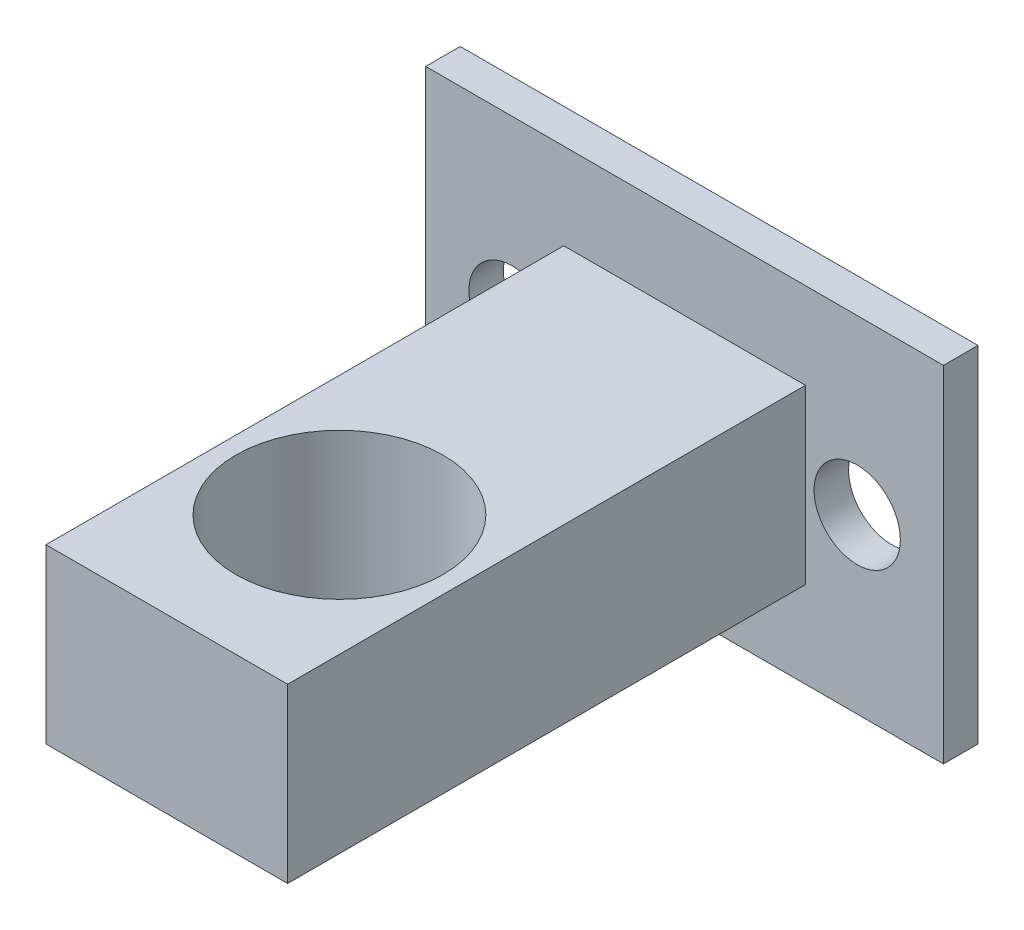
ISO-10303-21;
HEADER;
FILE_DESCRIPTION(('STEP AP214'),'2;1');
FILE_NAME('part.step','',(''),(''),'','','');
FILE_SCHEMA(('AUTOMOTIVE_DESIGN { 1 0 10303 214 1 1 1 1 }'));
ENDSEC;
DATA;
#1=APPLICATION_CONTEXT('core data for automotive mechanical design processes');
#2=APPLICATION_PROTOCOL_DEFINITION('international standard','automotive_design',2000,#1);
#3=PRODUCT_CONTEXT('',#1,'mechanical');
#4=PRODUCT('Part','Part','',(#3));
#5=PRODUCT_RELATED_PRODUCT_CATEGORY('part','',(#4));
#6=PRODUCT_DEFINITION_FORMATION('','',#4);
#7=PRODUCT_DEFINITION_CONTEXT('part definition',#1,'design');
#8=PRODUCT_DEFINITION('design','',#6,#7);
#9=PRODUCT_DEFINITION_SHAPE('','',#8);
#10=(LENGTH_UNIT() NAMED_UNIT(*) SI_UNIT(.MILLI.,.METRE.));
#11=(NAMED_UNIT(*) PLANE_ANGLE_UNIT() SI_UNIT($,.RADIAN.));
#12=(NAMED_UNIT(*) SI_UNIT($,.STERADIAN.) SOLID_ANGLE_UNIT());
#13=UNCERTAINTY_MEASURE_WITH_UNIT(LENGTH_MEASURE(1.E-05),#10,'distance_accuracy_value','');
#14=(GEOMETRIC_REPRESENTATION_CONTEXT(3) GLOBAL_UNCERTAINTY_ASSIGNED_CONTEXT((#13)) GLOBAL_UNIT_ASSIGNED_CONTEXT((#10,
#11,#12)) REPRESENTATION_CONTEXT('',''));
#15=CARTESIAN_POINT('',(0.,0.,0.));
#16=DIRECTION('',(0.,0.,1.));
#17=DIRECTION('',(1.,0.,0.));
#18=AXIS2_PLACEMENT_3D('',#15,#16,#17);
#19=CARTESIAN_POINT('',(0.,0.,2.));
#20=DIRECTION('',(0.,0.,-1.));
#21=DIRECTION('',(-1.,0.,0.));
#22=AXIS2_PLACEMENT_3D('',#19,#20,#21);
#23=PLANE('',#22);
#24=CARTESIAN_POINT('',(-5.82193865754765,8.4931631945286,2.));
#25=DIRECTION('',(0.,0.,1.));
#26=DIRECTION('',(1.,0.,0.));
#27=AXIS2_PLACEMENT_3D('',#24,#25,#26);
#28=CIRCLE('',#27,2.5);
#29=CARTESIAN_POINT('',(-3.32193865754765,8.4931631945286,2.));
#30=VERTEX_POINT('',#29);
#31=EDGE_CURVE('E125',#30,#30,#28,.T.);
#32=ORIENTED_EDGE('',*,*,#31,.F.);
#33=EDGE_LOOP('',(#32));
#34=FACE_BOUND('',#33,.T.);
#35=CARTESIAN_POINT('',(-25.8219386575476,8.4931631945286,2.));
#36=DIRECTION('',(0.,0.,1.));
#37=DIRECTION('',(1.,0.,0.));
#38=AXIS2_PLACEMENT_3D('',#35,#36,#37);
#39=CIRCLE('',#38,2.5);
#40=CARTESIAN_POINT('',(-23.3219386575476,8.4931631945286,2.));
#41=VERTEX_POINT('',#40);
#42=EDGE_CURVE('E134',#41,#41,#39,.T.);
#43=ORIENTED_EDGE('',*,*,#42,.F.);
#44=EDGE_LOOP('',(#43));
#45=FACE_BOUND('',#44,.T.);
#46=DIRECTION('',(0.,-1.,0.));
#47=VECTOR('',#46,1.);
#48=CARTESIAN_POINT('',(-30.8219386575476,-1.50683680547141,2.));
#49=LINE('',#48,#47);
#50=CARTESIAN_POINT('',(-30.8219386575476,18.4931631945286,2.));
#51=VERTEX_POINT('',#50);
#52=CARTESIAN_POINT('',(-30.8219386575476,-1.50683680547141,2.));
#53=VERTEX_POINT('',#52);
#54=EDGE_CURVE('E140',#51,#53,#49,.T.);
#55=ORIENTED_EDGE('',*,*,#54,.T.);
#56=DIRECTION('',(1.,0.,0.));
#57=VECTOR('',#56,1.);
#58=CARTESIAN_POINT('',(-0.821938657547647,-1.50683680547141,2.));
#59=LINE('',#58,#57);
#60=CARTESIAN_POINT('',(-0.821938657547647,-1.50683680547141,2.));
#61=VERTEX_POINT('',#60);
#62=EDGE_CURVE('E143',#53,#61,#59,.T.);
#63=ORIENTED_EDGE('',*,*,#62,.T.);
#64=DIRECTION('',(0.,1.,0.));
#65=VECTOR('',#64,1.);
#66=CARTESIAN_POINT('',(-0.821938657547649,8.4931631945286,2.));
#67=LINE('',#66,#65);
#68=CARTESIAN_POINT('',(-0.821938657547649,18.4931631945286,2.));
#69=VERTEX_POINT('',#68);
#70=EDGE_CURVE('E146',#61,#69,#67,.T.);
#71=ORIENTED_EDGE('',*,*,#70,.T.);
#72=DIRECTION('',(-1.,0.,0.));
#73=VECTOR('',#72,1.);
#74=CARTESIAN_POINT('',(-30.8219386575476,18.4931631945286,2.));
#75=LINE('',#74,#73);
#76=EDGE_CURVE('E148',#69,#51,#75,.T.);
#77=ORIENTED_EDGE('',*,*,#76,.T.);
#78=EDGE_LOOP('',(#55,#63,#71,#77));
#79=FACE_BOUND('',#78,.T.);
#80=DIRECTION('',(0.,-1.,0.));
#81=VECTOR('',#80,1.);
#82=CARTESIAN_POINT('',(-22.8219386575476,13.4931631945286,2.));
#83=LINE('',#82,#81);
#84=CARTESIAN_POINT('',(-22.8219386575476,13.4931631945286,2.));
#85=VERTEX_POINT('',#84);
#86=CARTESIAN_POINT('',(-22.8219386575476,3.4931631945286,2.));
#87=VERTEX_POINT('',#86);
#88=EDGE_CURVE('E121',#85,#87,#83,.T.);
#89=ORIENTED_EDGE('',*,*,#88,.F.);
#90=DIRECTION('',(-1.,0.,0.));
#91=VECTOR('',#90,1.);
#92=CARTESIAN_POINT('',(-15.8219386575476,13.4931631945286,2.));
#93=LINE('',#92,#91);
#94=CARTESIAN_POINT('',(-8.82193865754765,13.4931631945286,2.));
#95=VERTEX_POINT('',#94);
#96=EDGE_CURVE('E118',#95,#85,#93,.T.);
#97=ORIENTED_EDGE('',*,*,#96,.F.);
#98=DIRECTION('',(0.,1.,0.));
#99=VECTOR('',#98,1.);
#100=CARTESIAN_POINT('',(-8.82193865754765,3.49316319452859,2.));
#101=LINE('',#100,#99);
#102=CARTESIAN_POINT('',(-8.82193865754765,3.49316319452859,2.));
#103=VERTEX_POINT('',#102);
#104=EDGE_CURVE('E56',#103,#95,#101,.T.);
#105=ORIENTED_EDGE('',*,*,#104,.F.);
#106=DIRECTION('',(1.,0.,0.));
#107=VECTOR('',#106,1.);
#108=CARTESIAN_POINT('',(-22.8219386575476,3.4931631945286,2.));
#109=LINE('',#108,#107);
#110=EDGE_CURVE('E51',#87,#103,#109,.T.);
#111=ORIENTED_EDGE('',*,*,#110,.F.);
#112=EDGE_LOOP('',(#89,#97,#105,#111));
#113=FACE_BOUND('',#112,.T.);
#114=ADVANCED_FACE('F35',(#34,#45,#79,#113),#23,.F.);
#115=CARTESIAN_POINT('',(0.,0.,0.));
#116=DIRECTION('',(0.,0.,-1.));
#117=DIRECTION('',(-1.,0.,0.));
#118=AXIS2_PLACEMENT_3D('',#115,#116,#117);
#119=PLANE('',#118);
#120=CARTESIAN_POINT('',(-25.8219386575476,8.4931631945286,0.));
#121=DIRECTION('',(0.,0.,1.));
#122=DIRECTION('',(1.,0.,0.));
#123=AXIS2_PLACEMENT_3D('',#120,#121,#122);
#124=CIRCLE('',#123,2.5);
#125=CARTESIAN_POINT('',(-23.3219386575476,8.4931631945286,0.));
#126=VERTEX_POINT('',#125);
#127=EDGE_CURVE('E132',#126,#126,#124,.T.);
#128=ORIENTED_EDGE('',*,*,#127,.T.);
#129=EDGE_LOOP('',(#128));
#130=FACE_BOUND('',#129,.T.);
#131=DIRECTION('',(0.,-1.,0.));
#132=VECTOR('',#131,1.);
#133=CARTESIAN_POINT('',(-30.8219386575476,-1.50683680547141,0.));
#134=LINE('',#133,#132);
#135=CARTESIAN_POINT('',(-30.8219386575476,18.4931631945286,0.));
#136=VERTEX_POINT('',#135);
#137=CARTESIAN_POINT('',(-30.8219386575476,-1.50683680547141,0.));
#138=VERTEX_POINT('',#137);
#139=EDGE_CURVE('E137',#136,#138,#134,.T.);
#140=ORIENTED_EDGE('',*,*,#139,.F.);
#141=DIRECTION('',(-1.,0.,0.));
#142=VECTOR('',#141,1.);
#143=CARTESIAN_POINT('',(-30.8219386575476,18.4931631945286,0.));
#144=LINE('',#143,#142);
#145=CARTESIAN_POINT('',(-0.821938657547649,18.4931631945286,0.));
#146=VERTEX_POINT('',#145);
#147=EDGE_CURVE('E144',#146,#136,#144,.T.);
#148=ORIENTED_EDGE('',*,*,#147,.F.);
#149=DIRECTION('',(0.,1.,0.));
#150=VECTOR('',#149,1.);
#151=CARTESIAN_POINT('',(-0.821938657547649,18.4931631945286,0.));
#152=LINE('',#151,#150);
#153=CARTESIAN_POINT('',(-0.821938657547647,-1.50683680547141,0.));
#154=VERTEX_POINT('',#153);
#155=EDGE_CURVE('E156',#154,#146,#152,.T.);
#156=ORIENTED_EDGE('',*,*,#155,.F.);
#157=DIRECTION('',(1.,0.,0.));
#158=VECTOR('',#157,1.);
#159=CARTESIAN_POINT('',(-0.821938657547647,-1.50683680547141,0.));
#160=LINE('',#159,#158);
#161=EDGE_CURVE('E153',#138,#154,#160,.T.);
#162=ORIENTED_EDGE('',*,*,#161,.F.);
#163=EDGE_LOOP('',(#140,#148,#156,#162));
#164=FACE_BOUND('',#163,.T.);
#165=CARTESIAN_POINT('',(-5.82193865754765,8.4931631945286,0.));
#166=DIRECTION('',(0.,0.,1.));
#167=DIRECTION('',(1.,0.,0.));
#168=AXIS2_PLACEMENT_3D('',#165,#166,#167);
#169=CIRCLE('',#168,2.5);
#170=CARTESIAN_POINT('',(-3.32193865754765,8.4931631945286,0.));
#171=VERTEX_POINT('',#170);
#172=EDGE_CURVE('E122',#171,#171,#169,.T.);
#173=ORIENTED_EDGE('',*,*,#172,.T.);
#174=EDGE_LOOP('',(#173));
#175=FACE_BOUND('',#174,.T.);
#176=ADVANCED_FACE('F175',(#130,#164,#175),#119,.T.);
#177=CARTESIAN_POINT('',(-30.8219386575476,-1.50683680547141,2.));
#178=DIRECTION('',(1.,0.,0.));
#179=DIRECTION('',(0.,0.,-1.));
#180=AXIS2_PLACEMENT_3D('',#177,#178,#179);
#181=PLANE('',#180);
#182=ORIENTED_EDGE('',*,*,#139,.T.);
#183=DIRECTION('',(0.,0.,-1.));
#184=VECTOR('',#183,1.);
#185=CARTESIAN_POINT('',(-30.8219386575476,-1.50683680547141,2.));
#186=LINE('',#185,#184);
#187=EDGE_CURVE('E11',#53,#138,#186,.T.);
#188=ORIENTED_EDGE('',*,*,#187,.F.);
#189=ORIENTED_EDGE('',*,*,#54,.F.);
#190=DIRECTION('',(0.,0.,-1.));
#191=VECTOR('',#190,1.);
#192=CARTESIAN_POINT('',(-30.8219386575476,18.4931631945286,2.));
#193=LINE('',#192,#191);
#194=EDGE_CURVE('E150',#51,#136,#193,.T.);
#195=ORIENTED_EDGE('',*,*,#194,.T.);
#196=EDGE_LOOP('',(#182,#188,#189,#195));
#197=FACE_BOUND('',#196,.T.);
#198=ADVANCED_FACE('F37',(#197),#181,.F.);
#199=CARTESIAN_POINT('',(-0.821938657547647,-1.50683680547141,2.));
#200=DIRECTION('',(0.,1.,0.));
#201=DIRECTION('',(0.,0.,1.));
#202=AXIS2_PLACEMENT_3D('',#199,#200,#201);
#203=PLANE('',#202);
#204=ORIENTED_EDGE('',*,*,#161,.T.);
#205=DIRECTION('',(0.,0.,-1.));
#206=VECTOR('',#205,1.);
#207=CARTESIAN_POINT('',(-0.821938657547647,-1.50683680547141,2.));
#208=LINE('',#207,#206);
#209=EDGE_CURVE('E44',#61,#154,#208,.T.);
#210=ORIENTED_EDGE('',*,*,#209,.F.);
#211=ORIENTED_EDGE('',*,*,#62,.F.);
#212=ORIENTED_EDGE('',*,*,#187,.T.);
#213=EDGE_LOOP('',(#204,#210,#211,#212));
#214=FACE_BOUND('',#213,.T.);
#215=ADVANCED_FACE('F171',(#214),#203,.F.);
#216=CARTESIAN_POINT('',(-0.821938657547649,18.4931631945286,2.));
#217=DIRECTION('',(-1.,0.,0.));
#218=DIRECTION('',(0.,0.,1.));
#219=AXIS2_PLACEMENT_3D('',#216,#217,#218);
#220=PLANE('',#219);
#221=ORIENTED_EDGE('',*,*,#155,.T.);
#222=DIRECTION('',(0.,0.,-1.));
#223=VECTOR('',#222,1.);
#224=CARTESIAN_POINT('',(-0.821938657547649,18.4931631945286,2.));
#225=LINE('',#224,#223);
#226=EDGE_CURVE('E161',#69,#146,#225,.T.);
#227=ORIENTED_EDGE('',*,*,#226,.F.);
#228=ORIENTED_EDGE('',*,*,#70,.F.);
#229=ORIENTED_EDGE('',*,*,#209,.T.);
#230=EDGE_LOOP('',(#221,#227,#228,#229));
#231=FACE_BOUND('',#230,.T.);
#232=ADVANCED_FACE('F168',(#231),#220,.F.);
#233=CARTESIAN_POINT('',(-30.8219386575476,18.4931631945286,2.));
#234=DIRECTION('',(0.,-1.,0.));
#235=DIRECTION('',(0.,0.,-1.));
#236=AXIS2_PLACEMENT_3D('',#233,#234,#235);
#237=PLANE('',#236);
#238=ORIENTED_EDGE('',*,*,#147,.T.);
#239=ORIENTED_EDGE('',*,*,#194,.F.);
#240=ORIENTED_EDGE('',*,*,#76,.F.);
#241=ORIENTED_EDGE('',*,*,#226,.T.);
#242=EDGE_LOOP('',(#238,#239,#240,#241));
#243=FACE_BOUND('',#242,.T.);
#244=ADVANCED_FACE('F180',(#243),#237,.F.);
#245=CARTESIAN_POINT('',(-25.8219386575476,8.4931631945286,2.));
#246=DIRECTION('',(0.,0.,-1.));
#247=DIRECTION('',(-1.,0.,0.));
#248=AXIS2_PLACEMENT_3D('',#245,#246,#247);
#249=CYLINDRICAL_SURFACE('',#248,2.5);
#250=ORIENTED_EDGE('',*,*,#42,.T.);
#251=EDGE_LOOP('',(#250));
#252=FACE_BOUND('',#251,.T.);
#253=ORIENTED_EDGE('',*,*,#127,.F.);
#254=EDGE_LOOP('',(#253));
#255=FACE_BOUND('',#254,.T.);
#256=ADVANCED_FACE('F232',(#252,#255),#249,.F.);
#257=CARTESIAN_POINT('',(-5.82193865754765,8.4931631945286,2.));
#258=DIRECTION('',(0.,0.,-1.));
#259=DIRECTION('',(-1.,0.,0.));
#260=AXIS2_PLACEMENT_3D('',#257,#258,#259);
#261=CYLINDRICAL_SURFACE('',#260,2.5);
#262=ORIENTED_EDGE('',*,*,#31,.T.);
#263=EDGE_LOOP('',(#262));
#264=FACE_BOUND('',#263,.T.);
#265=ORIENTED_EDGE('',*,*,#172,.F.);
#266=EDGE_LOOP('',(#265));
#267=FACE_BOUND('',#266,.T.);
#268=ADVANCED_FACE('F229',(#264,#267),#261,.F.);
#269=CARTESIAN_POINT('',(-22.8219386575476,13.4931631945286,32.));
#270=DIRECTION('',(1.,0.,0.));
#271=DIRECTION('',(0.,0.,-1.));
#272=AXIS2_PLACEMENT_3D('',#269,#270,#271);
#273=PLANE('',#272);
#274=ORIENTED_EDGE('',*,*,#88,.T.);
#275=DIRECTION('',(0.,0.,-1.));
#276=VECTOR('',#275,1.);
#277=CARTESIAN_POINT('',(-22.8219386575476,3.4931631945286,32.));
#278=LINE('',#277,#276);
#279=CARTESIAN_POINT('',(-22.8219386575476,3.4931631945286,32.));
#280=VERTEX_POINT('',#279);
#281=EDGE_CURVE('E102',#280,#87,#278,.T.);
#282=ORIENTED_EDGE('',*,*,#281,.F.);
#283=DIRECTION('',(0.,-1.,0.));
#284=VECTOR('',#283,1.);
#285=CARTESIAN_POINT('',(-22.8219386575476,13.4931631945286,32.));
#286=LINE('',#285,#284);
#287=CARTESIAN_POINT('',(-22.8219386575476,13.4931631945286,32.));
#288=VERTEX_POINT('',#287);
#289=EDGE_CURVE('E109',#288,#280,#286,.T.);
#290=ORIENTED_EDGE('',*,*,#289,.F.);
#291=DIRECTION('',(0.,0.,-1.));
#292=VECTOR('',#291,1.);
#293=CARTESIAN_POINT('',(-22.8219386575476,13.4931631945286,32.));
#294=LINE('',#293,#292);
#295=EDGE_CURVE('E193',#288,#85,#294,.T.);
#296=ORIENTED_EDGE('',*,*,#295,.T.);
#297=EDGE_LOOP('',(#274,#282,#290,#296));
#298=FACE_BOUND('',#297,.T.);
#299=ADVANCED_FACE('F120',(#298),#273,.F.);
#300=CARTESIAN_POINT('',(-22.8219386575476,3.4931631945286,32.));
#301=DIRECTION('',(0.,1.,0.));
#302=DIRECTION('',(-1.,0.,0.));
#303=AXIS2_PLACEMENT_3D('',#300,#301,#302);
#304=PLANE('',#303);
#305=CARTESIAN_POINT('',(-15.8219386575476,3.49316319452859,22.));
#306=DIRECTION('',(0.,-1.,0.));
#307=DIRECTION('',(0.,0.,-1.));
#308=AXIS2_PLACEMENT_3D('',#305,#306,#307);
#309=CIRCLE('',#308,6.);
#310=CARTESIAN_POINT('',(-15.8219386575476,3.49316319452859,16.));
#311=VERTEX_POINT('',#310);
#312=EDGE_CURVE('E202',#311,#311,#309,.T.);
#313=ORIENTED_EDGE('',*,*,#312,.F.);
#314=EDGE_LOOP('',(#313));
#315=FACE_BOUND('',#314,.T.);
#316=ORIENTED_EDGE('',*,*,#110,.T.);
#317=DIRECTION('',(0.,0.,-1.));
#318=VECTOR('',#317,1.);
#319=CARTESIAN_POINT('',(-8.82193865754765,3.49316319452859,32.));
#320=LINE('',#319,#318);
#321=CARTESIAN_POINT('',(-8.82193865754765,3.49316319452859,32.));
#322=VERTEX_POINT('',#321);
#323=EDGE_CURVE('E105',#322,#103,#320,.T.);
#324=ORIENTED_EDGE('',*,*,#323,.F.);
#325=DIRECTION('',(1.,0.,0.));
#326=VECTOR('',#325,1.);
#327=CARTESIAN_POINT('',(-22.8219386575476,3.4931631945286,32.));
#328=LINE('',#327,#326);
#329=EDGE_CURVE('E98',#280,#322,#328,.T.);
#330=ORIENTED_EDGE('',*,*,#329,.F.);
#331=ORIENTED_EDGE('',*,*,#281,.T.);
#332=EDGE_LOOP('',(#316,#324,#330,#331));
#333=FACE_BOUND('',#332,.T.);
#334=ADVANCED_FACE('F100',(#315,#333),#304,.F.);
#335=CARTESIAN_POINT('',(-8.82193865754765,3.49316319452859,32.));
#336=DIRECTION('',(-1.,0.,0.));
#337=DIRECTION('',(0.,-1.,0.));
#338=AXIS2_PLACEMENT_3D('',#335,#336,#337);
#339=PLANE('',#338);
#340=ORIENTED_EDGE('',*,*,#104,.T.);
#341=DIRECTION('',(0.,0.,-1.));
#342=VECTOR('',#341,1.);
#343=CARTESIAN_POINT('',(-8.82193865754765,13.4931631945286,32.));
#344=LINE('',#343,#342);
#345=CARTESIAN_POINT('',(-8.82193865754765,13.4931631945286,32.));
#346=VERTEX_POINT('',#345);
#347=EDGE_CURVE('E127',#346,#95,#344,.T.);
#348=ORIENTED_EDGE('',*,*,#347,.F.);
#349=DIRECTION('',(0.,1.,0.));
#350=VECTOR('',#349,1.);
#351=CARTESIAN_POINT('',(-8.82193865754765,3.49316319452859,32.));
#352=LINE('',#351,#350);
#353=EDGE_CURVE('E108',#322,#346,#352,.T.);
#354=ORIENTED_EDGE('',*,*,#353,.F.);
#355=ORIENTED_EDGE('',*,*,#323,.T.);
#356=EDGE_LOOP('',(#340,#348,#354,#355));
#357=FACE_BOUND('',#356,.T.);
#358=ADVANCED_FACE('F220',(#357),#339,.F.);
#359=CARTESIAN_POINT('',(-15.8219386575476,13.4931631945286,32.));
#360=DIRECTION('',(0.,-1.,0.));
#361=DIRECTION('',(1.,0.,0.));
#362=AXIS2_PLACEMENT_3D('',#359,#360,#361);
#363=PLANE('',#362);
#364=CARTESIAN_POINT('',(-15.8219386575476,13.4931631945286,22.));
#365=DIRECTION('',(0.,-1.,0.));
#366=DIRECTION('',(1.,0.,0.));
#367=AXIS2_PLACEMENT_3D('',#364,#365,#366);
#368=CIRCLE('',#367,6.);
#369=CARTESIAN_POINT('',(-9.82193865754765,13.4931631945286,22.));
#370=VERTEX_POINT('',#369);
#371=EDGE_CURVE('E39',#370,#370,#368,.T.);
#372=ORIENTED_EDGE('',*,*,#371,.T.);
#373=EDGE_LOOP('',(#372));
#374=FACE_BOUND('',#373,.T.);
#375=ORIENTED_EDGE('',*,*,#96,.T.);
#376=ORIENTED_EDGE('',*,*,#295,.F.);
#377=DIRECTION('',(-1.,0.,0.));
#378=VECTOR('',#377,1.);
#379=CARTESIAN_POINT('',(-8.82193865754765,13.4931631945286,32.));
#380=LINE('',#379,#378);
#381=EDGE_CURVE('E114',#346,#288,#380,.T.);
#382=ORIENTED_EDGE('',*,*,#381,.F.);
#383=ORIENTED_EDGE('',*,*,#347,.T.);
#384=EDGE_LOOP('',(#375,#376,#382,#383));
#385=FACE_BOUND('',#384,.T.);
#386=ADVANCED_FACE('F192',(#374,#385),#363,.F.);
#387=CARTESIAN_POINT('',(0.,0.,32.));
#388=DIRECTION('',(0.,0.,1.));
#389=DIRECTION('',(1.,0.,0.));
#390=AXIS2_PLACEMENT_3D('',#387,#388,#389);
#391=PLANE('',#390);
#392=ORIENTED_EDGE('',*,*,#289,.T.);
#393=ORIENTED_EDGE('',*,*,#329,.T.);
#394=ORIENTED_EDGE('',*,*,#353,.T.);
#395=ORIENTED_EDGE('',*,*,#381,.T.);
#396=EDGE_LOOP('',(#392,#393,#394,#395));
#397=FACE_BOUND('',#396,.T.);
#398=ADVANCED_FACE('F112',(#397),#391,.T.);
#399=CARTESIAN_POINT('',(-15.8219386575476,18.4931631945286,22.));
#400=DIRECTION('',(0.,-1.,0.));
#401=DIRECTION('',(0.,0.,-1.));
#402=AXIS2_PLACEMENT_3D('',#399,#400,#401);
#403=CYLINDRICAL_SURFACE('',#402,6.);
#404=ORIENTED_EDGE('',*,*,#312,.T.);
#405=EDGE_LOOP('',(#404));
#406=FACE_BOUND('',#405,.T.);
#407=ORIENTED_EDGE('',*,*,#371,.F.);
#408=EDGE_LOOP('',(#407));
#409=FACE_BOUND('',#408,.T.);
#410=ADVANCED_FACE('F210',(#406,#409),#403,.F.);
#411=CLOSED_SHELL('',(#114,#176,#198,#215,#232,#244,#256,#268,#299,#334,#358,#386,#398,#410));
#412=MANIFOLD_SOLID_BREP('B2',#411);
#413=ADVANCED_BREP_SHAPE_REPRESENTATION('',(#18,#412),#14);
#414=SHAPE_DEFINITION_REPRESENTATION(#9,#413);
ENDSEC;
END-ISO-10303-21;
